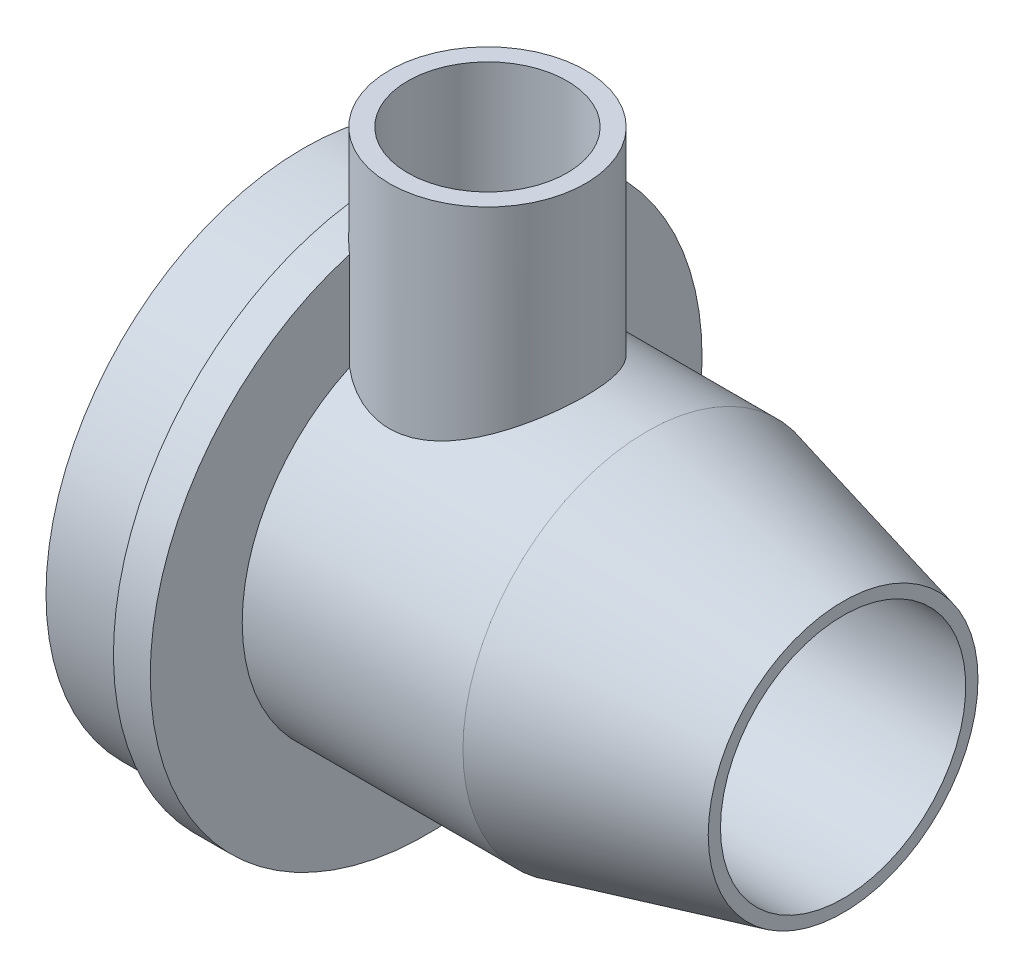
ISO-10303-21;
HEADER;
FILE_DESCRIPTION(('STEP AP214'),'2;1');
FILE_NAME('part.step','',(''),(''),'','','');
FILE_SCHEMA(('AUTOMOTIVE_DESIGN { 1 0 10303 214 1 1 1 1 }'));
ENDSEC;
DATA;
#1=APPLICATION_CONTEXT('core data for automotive mechanical design processes');
#2=APPLICATION_PROTOCOL_DEFINITION('international standard','automotive_design',2000,#1);
#3=PRODUCT_CONTEXT('',#1,'mechanical');
#4=PRODUCT('Part','Part','',(#3));
#5=PRODUCT_RELATED_PRODUCT_CATEGORY('part','',(#4));
#6=PRODUCT_DEFINITION_FORMATION('','',#4);
#7=PRODUCT_DEFINITION_CONTEXT('part definition',#1,'design');
#8=PRODUCT_DEFINITION('design','',#6,#7);
#9=PRODUCT_DEFINITION_SHAPE('','',#8);
#10=(LENGTH_UNIT() NAMED_UNIT(*) SI_UNIT(.MILLI.,.METRE.));
#11=(NAMED_UNIT(*) PLANE_ANGLE_UNIT() SI_UNIT($,.RADIAN.));
#12=(NAMED_UNIT(*) SI_UNIT($,.STERADIAN.) SOLID_ANGLE_UNIT());
#13=UNCERTAINTY_MEASURE_WITH_UNIT(LENGTH_MEASURE(1.E-05),#10,'distance_accuracy_value','');
#14=(GEOMETRIC_REPRESENTATION_CONTEXT(3) GLOBAL_UNCERTAINTY_ASSIGNED_CONTEXT((#13)) GLOBAL_UNIT_ASSIGNED_CONTEXT((#10,
#11,#12)) REPRESENTATION_CONTEXT('',''));
#15=CARTESIAN_POINT('',(0.,0.,0.));
#16=DIRECTION('',(0.,0.,1.));
#17=DIRECTION('',(1.,0.,0.));
#18=AXIS2_PLACEMENT_3D('',#15,#16,#17);
#19=CARTESIAN_POINT('',(0.,9.99999999999999,0.));
#20=DIRECTION('',(1.,0.,0.));
#21=DIRECTION('',(0.,0.,-1.));
#22=AXIS2_PLACEMENT_3D('',#19,#20,#21);
#23=PLANE('',#22);
#24=CARTESIAN_POINT('',(0.,0.,0.));
#25=DIRECTION('',(-1.,0.,0.));
#26=DIRECTION('',(0.,0.,1.));
#27=AXIS2_PLACEMENT_3D('',#24,#25,#26);
#28=CIRCLE('',#27,9.99999999999999);
#29=CARTESIAN_POINT('',(0.,0.,9.99999999999999));
#30=VERTEX_POINT('',#29);
#31=EDGE_CURVE('E110',#30,#30,#28,.T.);
#32=ORIENTED_EDGE('',*,*,#31,.F.);
#33=EDGE_LOOP('',(#32));
#34=FACE_BOUND('',#33,.T.);
#35=CARTESIAN_POINT('',(0.,0.,0.));
#36=DIRECTION('',(-1.,0.,0.));
#37=DIRECTION('',(0.,0.,1.));
#38=AXIS2_PLACEMENT_3D('',#35,#36,#37);
#39=CIRCLE('',#38,21.);
#40=CARTESIAN_POINT('',(0.,0.,21.));
#41=VERTEX_POINT('',#40);
#42=EDGE_CURVE('E11',#41,#41,#39,.T.);
#43=ORIENTED_EDGE('',*,*,#42,.T.);
#44=EDGE_LOOP('',(#43));
#45=FACE_BOUND('',#44,.T.);
#46=ADVANCED_FACE('F37',(#34,#45),#23,.F.);
#47=CARTESIAN_POINT('',(0.,0.,0.));
#48=DIRECTION('',(-1.,0.,0.));
#49=DIRECTION('',(0.,0.,1.));
#50=AXIS2_PLACEMENT_3D('',#47,#48,#49);
#51=CYLINDRICAL_SURFACE('',#50,21.);
#52=ORIENTED_EDGE('',*,*,#42,.F.);
#53=EDGE_LOOP('',(#52));
#54=FACE_BOUND('',#53,.T.);
#55=CARTESIAN_POINT('',(7.,0.,0.));
#56=DIRECTION('',(-1.,0.,0.));
#57=DIRECTION('',(0.,0.,1.));
#58=AXIS2_PLACEMENT_3D('',#55,#56,#57);
#59=CIRCLE('',#58,21.);
#60=CARTESIAN_POINT('',(7.,0.,21.));
#61=VERTEX_POINT('',#60);
#62=EDGE_CURVE('E44',#61,#61,#59,.T.);
#63=ORIENTED_EDGE('',*,*,#62,.T.);
#64=EDGE_LOOP('',(#63));
#65=FACE_BOUND('',#64,.T.);
#66=ADVANCED_FACE('F91',(#54,#65),#51,.T.);
#67=CARTESIAN_POINT('',(7.,21.,0.));
#68=DIRECTION('',(1.,0.,0.));
#69=DIRECTION('',(0.,0.,-1.));
#70=AXIS2_PLACEMENT_3D('',#67,#68,#69);
#71=PLANE('',#70);
#72=ORIENTED_EDGE('',*,*,#62,.F.);
#73=EDGE_LOOP('',(#72));
#74=FACE_BOUND('',#73,.T.);
#75=CARTESIAN_POINT('',(7.,0.,0.));
#76=DIRECTION('',(-1.,0.,0.));
#77=DIRECTION('',(0.,0.,1.));
#78=AXIS2_PLACEMENT_3D('',#75,#76,#77);
#79=CIRCLE('',#78,22.5);
#80=CARTESIAN_POINT('',(6.99999999999999,22.5,0.));
#81=VERTEX_POINT('',#80);
#82=EDGE_CURVE('E82',#81,#81,#79,.T.);
#83=ORIENTED_EDGE('',*,*,#82,.T.);
#84=EDGE_LOOP('',(#83));
#85=FACE_BOUND('',#84,.T.);
#86=ADVANCED_FACE('F93',(#74,#85),#71,.F.);
#87=CARTESIAN_POINT('',(0.,0.,0.));
#88=DIRECTION('',(-1.,0.,0.));
#89=DIRECTION('',(0.,0.,1.));
#90=AXIS2_PLACEMENT_3D('',#87,#88,#89);
#91=CYLINDRICAL_SURFACE('',#90,22.5);
#92=CARTESIAN_POINT('',(10.,0.,0.));
#93=DIRECTION('',(-1.,0.,0.));
#94=DIRECTION('',(0.,0.,1.));
#95=AXIS2_PLACEMENT_3D('',#92,#93,#94);
#96=CIRCLE('',#95,22.5);
#97=CARTESIAN_POINT('',(10.,21.6159663212173,-6.2449979983984));
#98=VERTEX_POINT('',#97);
#99=CARTESIAN_POINT('',(10.,21.6159663212173,6.2449979983984));
#100=VERTEX_POINT('',#99);
#101=EDGE_CURVE('E76',#98,#100,#96,.T.);
#102=ORIENTED_EDGE('',*,*,#101,.T.);
#103=CARTESIAN_POINT('',(15.,21.0297408448131,8.));
#104=CARTESIAN_POINT('',(15.2169039393865,21.0297403686148,8.00000055406925));
#105=CARTESIAN_POINT('',(15.4337999515287,21.0331056548089,7.99117141501444));
#106=CARTESIAN_POINT('',(15.8659578973729,21.0464543534831,7.95594837302906));
#107=CARTESIAN_POINT('',(16.0812198246633,21.0564377919173,7.92955440121525));
#108=CARTESIAN_POINT('',(16.5085145057331,21.0826975089156,7.85946951092131));
#109=CARTESIAN_POINT('',(16.7205472361938,21.0989738328995,7.81577846759695));
#110=CARTESIAN_POINT('',(17.1398864359343,21.1373014306634,7.71152174406925));
#111=CARTESIAN_POINT('',(17.3471928134739,21.1593528164359,7.65095573661765));
#112=CARTESIAN_POINT('',(17.7551941494095,21.2084929220989,7.51366254204978));
#113=CARTESIAN_POINT('',(17.9559038819811,21.2355693329456,7.43697478627154));
#114=CARTESIAN_POINT('',(18.3500524123259,21.2940096066575,7.26795347678701));
#115=CARTESIAN_POINT('',(18.5434886487771,21.3253749621535,7.1756144734702));
#116=CARTESIAN_POINT('',(18.921855259657,21.391499452057,6.97601583295978));
#117=CARTESIAN_POINT('',(19.106786800709,21.4262581189354,6.86875825038007));
#118=CARTESIAN_POINT('',(19.4672039919307,21.4982490780662,6.64000490158324));
#119=CARTESIAN_POINT('',(19.6426862021065,21.5354822602825,6.51850400059873));
#120=CARTESIAN_POINT('',(19.9900612817578,21.6129798084297,6.25687269809314));
#121=CARTESIAN_POINT('',(20.1615233518349,21.6533058628257,6.11618828389427));
#122=CARTESIAN_POINT('',(20.4921173310216,21.7344811261713,5.8211455977019));
#123=CARTESIAN_POINT('',(20.6512489649995,21.7753303467709,5.6667870207585));
#124=CARTESIAN_POINT('',(20.9562817472376,21.8564787978259,5.34526232392203));
#125=CARTESIAN_POINT('',(21.1021781295122,21.8967778257555,5.17809163007548));
#126=CARTESIAN_POINT('',(21.3797040628434,21.9757350161796,4.83203409050684));
#127=CARTESIAN_POINT('',(21.511338559477,22.0143937446315,4.65315134090452));
#128=CARTESIAN_POINT('',(21.7633112487399,22.0902127502264,4.27902188246688));
#129=CARTESIAN_POINT('',(21.883179839982,22.1272908410294,4.08344174585761));
#130=CARTESIAN_POINT('',(22.1058883366947,22.1975783460871,3.68225021031342));
#131=CARTESIAN_POINT('',(22.2087350227841,22.2307892992325,3.47664284815115));
#132=CARTESIAN_POINT('',(22.3965724735522,22.2924069822151,3.05673246199958));
#133=CARTESIAN_POINT('',(22.4815637192329,22.3208138414643,2.8424296724393));
#134=CARTESIAN_POINT('',(22.6328933020882,22.3719910721917,2.40668348611882));
#135=CARTESIAN_POINT('',(22.6992325582303,22.3947617213548,2.18524044175233));
#136=CARTESIAN_POINT('',(22.8103712274878,22.4332184376016,1.74569738261162));
#137=CARTESIAN_POINT('',(22.8559123801302,22.4491470085616,1.52780601401671));
#138=CARTESIAN_POINT('',(22.9287096609528,22.4747251862976,1.08862419151065));
#139=CARTESIAN_POINT('',(22.9559662243641,22.4843749425292,0.867333818634822));
#140=CARTESIAN_POINT('',(22.9919093583613,22.4971183142438,0.423117420772445));
#141=CARTESIAN_POINT('',(23.0006005854866,22.5002135737175,0.200191820011438));
#142=CARTESIAN_POINT('',(22.9993349889896,22.4997635194707,-0.245596806559894));
#143=CARTESIAN_POINT('',(22.989378664562,22.4962183835135,-0.468459833885575));
#144=CARTESIAN_POINT('',(22.9517876265751,22.4828965641572,-0.902421744924401));
#145=CARTESIAN_POINT('',(22.9249648843196,22.4734061681598,-1.11360036870596));
#146=CARTESIAN_POINT('',(22.8546435485118,22.4487046715339,-1.53289877382041));
#147=CARTESIAN_POINT('',(22.8111390694734,22.4334915519064,-1.74101744863327));
#148=CARTESIAN_POINT('',(22.7078653777766,22.3977419694763,-2.15263135057575));
#149=CARTESIAN_POINT('',(22.6481016135791,22.3772072900292,-2.35612810179868));
#150=CARTESIAN_POINT('',(22.512788746036,22.3313220583874,-2.75732508679096));
#151=CARTESIAN_POINT('',(22.4372336722266,22.3059696850231,-2.9550230958089));
#152=CARTESIAN_POINT('',(22.2698248275447,22.2507084747718,-3.34596401264463));
#153=CARTESIAN_POINT('',(22.1777636430794,22.2207424335494,-3.53910995392889));
#154=CARTESIAN_POINT('',(21.9787225009039,22.1572487326462,-3.91702175511175));
#155=CARTESIAN_POINT('',(21.8717374482465,22.1237198575638,-4.10178472442894));
#156=CARTESIAN_POINT('',(21.6436097047798,22.0539284351763,-4.46182382190772));
#157=CARTESIAN_POINT('',(21.5224659639433,22.0176656851942,-4.63709924504806));
#158=CARTESIAN_POINT('',(21.2668027360823,21.9432873741216,-4.9771925187229));
#159=CARTESIAN_POINT('',(21.1322826930059,21.9051717360404,-5.14200993405197));
#160=CARTESIAN_POINT('',(20.8431588000139,21.8259515885422,-5.46878311089091));
#161=CARTESIAN_POINT('',(20.6878666330062,21.784796055896,-5.63011809380076));
#162=CARTESIAN_POINT('',(20.3643529082191,21.7025763271781,-5.93917070092542));
#163=CARTESIAN_POINT('',(20.1961353328408,21.6615121069528,-6.08689248884659));
#164=CARTESIAN_POINT('',(19.8476351474524,21.5805660746324,-6.36793286334688));
#165=CARTESIAN_POINT('',(19.6673457031558,21.5406849510807,-6.50124317753765));
#166=CARTESIAN_POINT('',(19.2959361616905,21.463273259543,-6.75241964522067));
#167=CARTESIAN_POINT('',(19.1048203305013,21.4257417778191,-6.87029182207639));
#168=CARTESIAN_POINT('',(18.7091905087449,21.353444199574,-7.09184454900366));
#169=CARTESIAN_POINT('',(18.5044929439604,21.3187428467966,-7.19521891340348));
#170=CARTESIAN_POINT('',(18.0864407055235,21.254023170503,-7.38420472541178));
#171=CARTESIAN_POINT('',(17.8730897188078,21.2240028784127,-7.46982364492303));
#172=CARTESIAN_POINT('',(17.4391943274511,21.1696329857442,-7.62254655377806));
#173=CARTESIAN_POINT('',(17.2186512388676,21.1452823542593,-7.68965390946476));
#174=CARTESIAN_POINT('',(16.7720099057222,21.1030948497716,-7.804687755483));
#175=CARTESIAN_POINT('',(16.5459119969732,21.0852575840367,-7.85261540229677));
#176=CARTESIAN_POINT('',(16.1014945182129,21.057459818449,-7.92684512222909));
#177=CARTESIAN_POINT('',(15.8833585937386,21.0471470937726,-7.95411688702874));
#178=CARTESIAN_POINT('',(15.4453690215624,21.0333176978434,-7.99061525009719));
#179=CARTESIAN_POINT('',(15.2255154319616,21.0298007977082,-7.99984245610485));
#180=CARTESIAN_POINT('',(14.7858370684396,21.0296824240172,-8.00015351644898));
#181=CARTESIAN_POINT('',(14.5660122970282,21.0330796306058,-7.99124083356596));
#182=CARTESIAN_POINT('',(14.1280551527975,21.0466715548744,-7.95537448676005));
#183=CARTESIAN_POINT('',(13.9099227533875,21.0568661655332,-7.92842110687718));
#184=CARTESIAN_POINT('',(13.4859360478107,21.0831560634668,-7.85823559575561));
#185=CARTESIAN_POINT('',(13.2799462734823,21.0989907931301,-7.81572029875206));
#186=CARTESIAN_POINT('',(12.8723441309343,21.1361233790069,-7.71473786814156));
#187=CARTESIAN_POINT('',(12.6707333290575,21.1574231562462,-7.65626512485136));
#188=CARTESIAN_POINT('',(12.2732871371124,21.2048587587824,-7.52388872662456));
#189=CARTESIAN_POINT('',(12.0774504539273,21.2309934916034,-7.44998855708794));
#190=CARTESIAN_POINT('',(11.6925957896652,21.2873828155832,-7.28730007419787));
#191=CARTESIAN_POINT('',(11.5035804410051,21.3176389761822,-7.19850608628251));
#192=CARTESIAN_POINT('',(11.1271143421938,21.3825556319026,-7.0033737998732));
#193=CARTESIAN_POINT('',(10.9399425438214,21.4173320637911,-6.89653591157544));
#194=CARTESIAN_POINT('',(10.5751154719962,21.4894767253579,-6.66833635221323));
#195=CARTESIAN_POINT('',(10.3974635057894,21.5268458455374,-6.54696968051342));
#196=CARTESIAN_POINT('',(10.052700948247,21.6031826607767,-6.29050051597282));
#197=CARTESIAN_POINT('',(9.88559164713597,21.6421505505366,-6.15539634718374));
#198=CARTESIAN_POINT('',(9.56285218904932,21.720683045534,-5.87226604091336));
#199=CARTESIAN_POINT('',(9.40722235338081,21.7602476674365,-5.72423954199262));
#200=CARTESIAN_POINT('',(9.0999109557493,21.8411963301025,-5.40743419775893));
#201=CARTESIAN_POINT('',(8.94894269529276,21.8825576767522,-5.23795663006815));
#202=CARTESIAN_POINT('',(8.66182910282255,21.9636847556591,-4.88661864826377));
#203=CARTESIAN_POINT('',(8.52567889948004,22.0034510095605,-4.70476233572327));
#204=CARTESIAN_POINT('',(8.26904953699842,22.0803237501562,-4.32966088554577));
#205=CARTESIAN_POINT('',(8.14857666435117,22.1174291672139,-4.13641122411906));
#206=CARTESIAN_POINT('',(7.92434012120138,22.1879164116791,-3.73990473891316));
#207=CARTESIAN_POINT('',(7.82056937285322,22.2212998145086,-3.53665220197823));
#208=CARTESIAN_POINT('',(7.63100283132751,22.2832701888114,-3.1224205481641));
#209=CARTESIAN_POINT('',(7.54512327054174,22.3118793820243,-2.91148313268091));
#210=CARTESIAN_POINT('',(7.39152631527466,22.3636679084546,-2.4825389576666));
#211=CARTESIAN_POINT('',(7.32380154300457,22.3868494468898,-2.26453511030527));
#212=CARTESIAN_POINT('',(7.20713956515717,22.4271191684516,-1.82303348337415));
#213=CARTESIAN_POINT('',(7.15819973389537,22.4442082031404,-1.59953647626659));
#214=CARTESIAN_POINT('',(7.0796060036813,22.4717885905069,-1.14877792247743));
#215=CARTESIAN_POINT('',(7.04995113254958,22.4822802757645,-0.921516566153846));
#216=CARTESIAN_POINT('',(7.01129756356565,22.4959788226846,-0.477180527821484));
#217=CARTESIAN_POINT('',(7.00128752498177,22.4995422609465,-0.260204221335547));
#218=CARTESIAN_POINT('',(6.99894548724806,22.5003748907887,0.173854135920281));
#219=CARTESIAN_POINT('',(7.00661305234478,22.4976442375187,0.390936183951765));
#220=CARTESIAN_POINT('',(7.0395478049048,22.4859637035569,0.823566433469688));
#221=CARTESIAN_POINT('',(7.06481316041561,22.4770144702274,1.03911479225582));
#222=CARTESIAN_POINT('',(7.13269435145875,22.4531398677818,1.46712365664306));
#223=CARTESIAN_POINT('',(7.17531020554786,22.438214492274,1.67958415894138));
#224=CARTESIAN_POINT('',(7.2764486308927,22.4031481336315,2.09562655519884));
#225=CARTESIAN_POINT('',(7.33462974176769,22.3831195055209,2.29930114560484));
#226=CARTESIAN_POINT('',(7.46677963793882,22.3382082570201,2.7009831625613));
#227=CARTESIAN_POINT('',(7.54075368694825,22.3133240185159,2.89898867461897));
#228=CARTESIAN_POINT('',(7.70386690735499,22.2593270292008,3.28799593804458));
#229=CARTESIAN_POINT('',(7.79300276154975,22.2302152035335,3.47899921032271));
#230=CARTESIAN_POINT('',(7.98582528850703,22.1684529254927,3.853003816085));
#231=CARTESIAN_POINT('',(8.08951757390176,22.1358011092896,4.03600202713024));
#232=CARTESIAN_POINT('',(8.31508603795478,22.0664022955244,4.39994875243892));
#233=CARTESIAN_POINT('',(8.43751814528258,22.0295445666565,4.58053168694211));
#234=CARTESIAN_POINT('',(8.69653731065842,21.9537764654284,4.93090726844277));
#235=CARTESIAN_POINT('',(8.83313076246327,21.9148651698226,5.10069498516603));
#236=CARTESIAN_POINT('',(9.1195819927899,21.8359877356758,5.42844885674597));
#237=CARTESIAN_POINT('',(9.26944095861232,21.7960215029401,5.58641395110501));
#238=CARTESIAN_POINT('',(9.58152603513098,21.7160565556558,5.88960726818061));
#239=CARTESIAN_POINT('',(9.74375236303727,21.676057840549,6.03483526709705));
#240=CARTESIAN_POINT('',(10.0874597398383,21.5952281410747,6.31813419672714));
#241=CARTESIAN_POINT('',(10.2694851816545,21.5544448205448,6.45555918397571));
#242=CARTESIAN_POINT('',(10.6448758791791,21.4751825880901,6.7145268094497));
#243=CARTESIAN_POINT('',(10.8382368540589,21.4367028171921,6.83607538808187));
#244=CARTESIAN_POINT('',(11.2352255335431,21.3631803430636,7.06248574190986));
#245=CARTESIAN_POINT('',(11.4388571063826,21.3281389496938,7.16734116719195));
#246=CARTESIAN_POINT('',(11.854888497244,21.2626329148589,7.35939803966408));
#247=CARTESIAN_POINT('',(12.0672844215919,21.232166268326,7.44660722689118));
#248=CARTESIAN_POINT('',(12.4996611293842,21.1767724194567,7.60270901671434));
#249=CARTESIAN_POINT('',(12.7196493580695,21.1518508439759,7.67158302750105));
#250=CARTESIAN_POINT('',(13.1653562303156,21.1084517934989,7.7902028005447));
#251=CARTESIAN_POINT('',(13.3910749055035,21.0899743540771,7.83994845720518));
#252=CARTESIAN_POINT('',(13.8463386883819,21.0601369581945,7.91975066298651));
#253=CARTESIAN_POINT('',(14.0758821667101,21.0487740467047,7.9498153868468));
#254=CARTESIAN_POINT('',(14.5369535197386,21.0335764679858,7.9899391648435));
#255=CARTESIAN_POINT('',(14.7684812756164,21.0297413530972,7.99999940859808));
#256=CARTESIAN_POINT('',(15.,21.0297408448131,8.));
#257=B_SPLINE_CURVE_WITH_KNOTS('',3,(#103,#104,#105,#106,#107,#108,#109,#110,#111,#112,#113,
#114,#115,#116,#117,#118,#119,#120,#121,#122,#123,#124,#125,#126,#127,#128,#129,#130,#131,#132,
#133,#134,#135,#136,#137,#138,#139,#140,#141,#142,#143,#144,#145,#146,#147,#148,#149,#150,#151,
#152,#153,#154,#155,#156,#157,#158,#159,#160,#161,#162,#163,#164,#165,#166,#167,#168,#169,#170,
#171,#172,#173,#174,#175,#176,#177,#178,#179,#180,#181,#182,#183,#184,#185,#186,#187,#188,#189,
#190,#191,#192,#193,#194,#195,#196,#197,#198,#199,#200,#201,#202,#203,#204,#205,#206,#207,#208,
#209,#210,#211,#212,#213,#214,#215,#216,#217,#218,#219,#220,#221,#222,#223,#224,#225,#226,#227,
#228,#229,#230,#231,#232,#233,#234,#235,#236,#237,#238,#239,#240,#241,#242,#243,#244,#245,#246,
#247,#248,#249,#250,#251,#252,#253,#254,#255,#256),.UNSPECIFIED.,.T.,.F.,(4,2,2,2,2,2,2,2,2,2,2,
2,2,2,2,2,2,2,2,2,2,2,2,2,2,2,2,2,2,2,2,2,2,2,2,2,2,2,2,2,2,2,2,2,2,2,2,2,2,2,2,2,2,2,2,2,2,2,2,
2,2,2,2,2,2,2,2,2,2,2,2,2,2,2,2,2,4),(0.,0.650493603027151,1.30098975708243,1.95149060627766,
2.60200407120866,3.25094461463127,3.90011157869133,4.5491892266569,5.19850159322882,
5.87402333153681,6.549560138568,7.2253392472695,7.90088326172102,8.5971225570843,
9.29308383683845,9.98902636590412,10.6849346004622,11.3535923077929,12.0222340983898,
12.6907081612062,13.3591643292351,13.9976737786639,14.6364087082877,15.2749298619206,
15.913692869228,16.561130766062,17.2087902389627,17.8564977736691,18.5042322447884,
19.1864917337398,19.868541850642,20.5509814180211,21.2331539256521,21.9280677825926,
22.6226886075729,23.317183031794,24.011635573653,24.671025391009,25.3303929998022,
25.9896347516415,26.6488661243566,27.2809229847016,27.9132023252733,28.5453389741176,
29.1777170171081,29.831911999174,30.4863327983323,31.1408335315823,31.7953525771818,
32.486651350567,33.1777221736407,33.8690692625735,34.5601226041314,35.247863826414,
35.9353251375268,36.622690323004,37.3100208548383,37.9609282028906,38.6118195062293,
39.2626430610764,39.913467311997,40.551043212784,41.1888319473482,41.8264813212296,
42.4643772371279,43.1274349994323,43.7907934426778,44.4542113185084,45.117640848743,
45.8118916075384,46.5058818528531,47.2001354578027,47.8940838842296,48.5887333147756,
49.2833865800198,49.9777511283253,50.6720743832117),.UNSPECIFIED.);
#258=EDGE_CURVE('E64',#81,#100,#257,.T.);
#259=ORIENTED_EDGE('',*,*,#258,.F.);
#260=ORIENTED_EDGE('',*,*,#82,.F.);
#261=EDGE_CURVE('E57',#98,#81,#257,.T.);
#262=ORIENTED_EDGE('',*,*,#261,.F.);
#263=EDGE_LOOP('',(#102,#259,#260,#262));
#264=FACE_BOUND('',#263,.T.);
#265=ADVANCED_FACE('F81',(#264),#91,.T.);
#266=CARTESIAN_POINT('',(10.,22.5,0.));
#267=DIRECTION('',(-1.,0.,0.));
#268=DIRECTION('',(0.,0.,1.));
#269=AXIS2_PLACEMENT_3D('',#266,#267,#268);
#270=PLANE('',#269);
#271=CARTESIAN_POINT('',(10.,0.,0.));
#272=DIRECTION('',(-1.,0.,0.));
#273=DIRECTION('',(0.,0.,1.));
#274=AXIS2_PLACEMENT_3D('',#271,#272,#273);
#275=CIRCLE('',#274,15.);
#276=CARTESIAN_POINT('',(10.,13.6381816969858,-6.2449979983984));
#277=VERTEX_POINT('',#276);
#278=CARTESIAN_POINT('',(10.,13.6381816969858,6.2449979983984));
#279=VERTEX_POINT('',#278);
#280=EDGE_CURVE('E78',#277,#279,#275,.T.);
#281=ORIENTED_EDGE('',*,*,#280,.T.);
#282=DIRECTION('',(0.,1.,0.));
#283=VECTOR('',#282,1.);
#284=CARTESIAN_POINT('',(10.,-22.502,6.2449979983984));
#285=LINE('',#284,#283);
#286=EDGE_CURVE('E51',#100,#279,#285,.F.);
#287=ORIENTED_EDGE('',*,*,#286,.F.);
#288=ORIENTED_EDGE('',*,*,#101,.F.);
#289=DIRECTION('',(0.,1.,0.));
#290=VECTOR('',#289,1.);
#291=CARTESIAN_POINT('',(10.,-22.502,-6.2449979983984));
#292=LINE('',#291,#290);
#293=EDGE_CURVE('E122',#277,#98,#292,.T.);
#294=ORIENTED_EDGE('',*,*,#293,.F.);
#295=EDGE_LOOP('',(#281,#287,#288,#294));
#296=FACE_BOUND('',#295,.T.);
#297=ADVANCED_FACE('F74',(#296),#270,.F.);
#298=CARTESIAN_POINT('',(0.,0.,0.));
#299=DIRECTION('',(-1.,0.,0.));
#300=DIRECTION('',(0.,0.,1.));
#301=AXIS2_PLACEMENT_3D('',#298,#299,#300);
#302=CYLINDRICAL_SURFACE('',#301,15.);
#303=ORIENTED_EDGE('',*,*,#280,.F.);
#304=CARTESIAN_POINT('',(15.,12.6885775404495,8.));
#305=CARTESIAN_POINT('',(15.2062807278142,12.6885765278676,8.00000082721682));
#306=CARTESIAN_POINT('',(15.4125521905369,12.6936244616965,7.99201174654624));
#307=CARTESIAN_POINT('',(15.8234599547187,12.7136132089408,7.96017537563484));
#308=CARTESIAN_POINT('',(16.0280956119096,12.728557742943,7.93632212130752));
#309=CARTESIAN_POINT('',(16.4343029929785,12.7677833039786,7.87306095334852));
#310=CARTESIAN_POINT('',(16.6358703345715,12.7920765809839,7.83363262937667));
#311=CARTESIAN_POINT('',(17.0343271601007,12.8491080572074,7.73973085972861));
#312=CARTESIAN_POINT('',(17.2312145301626,12.8818499962724,7.68525075053985));
#313=CARTESIAN_POINT('',(17.617774028385,12.9544169307915,7.56228385666899));
#314=CARTESIAN_POINT('',(17.8074842506989,12.9941952837498,7.49388888707304));
#315=CARTESIAN_POINT('',(18.1801055790204,13.0797616840841,7.3435222093617));
#316=CARTESIAN_POINT('',(18.363014165682,13.125551930383,7.26154553068372));
#317=CARTESIAN_POINT('',(18.7211610934478,13.2218490629248,7.0846895469615));
#318=CARTESIAN_POINT('',(18.8964005143577,13.2723552820083,6.9898120661042));
#319=CARTESIAN_POINT('',(19.2385247754625,13.3767912234906,6.78781438160603));
#320=CARTESIAN_POINT('',(19.4054093312025,13.4307210623105,6.68069376153462));
#321=CARTESIAN_POINT('',(19.9234942274333,13.6062056303797,6.32032913923123));
#322=CARTESIAN_POINT('',(20.2582015924694,13.7320055318079,6.04463813970563));
#323=CARTESIAN_POINT('',(20.7236252823563,13.9190407271586,5.59347847675013));
#324=CARTESIAN_POINT('',(20.8727421303169,13.98114670239,5.43671146220673));
#325=CARTESIAN_POINT('',(21.1582050160213,14.1034342850554,5.11109924634898));
#326=CARTESIAN_POINT('',(21.2945489901401,14.1636155805014,4.94225210107677));
#327=CARTESIAN_POINT('',(21.5638830240319,14.2852717014807,4.57935642046023));
#328=CARTESIAN_POINT('',(21.6957394295338,14.3464672523525,4.3843718855975));
#329=CARTESIAN_POINT('',(21.9423529059423,14.463211026805,3.98237404529215));
#330=CARTESIAN_POINT('',(22.0571173837356,14.5187616932942,3.77536600468325));
#331=CARTESIAN_POINT('',(22.2684185508285,14.6226346324678,3.35057394862973));
#332=CARTESIAN_POINT('',(22.364960678775,14.6709590609995,3.13279317298695));
#333=CARTESIAN_POINT('',(22.5386923688465,14.7589385631076,2.68795642145345));
#334=CARTESIAN_POINT('',(22.6158843238,14.7985947085199,2.4609015964273));
#335=CARTESIAN_POINT('',(22.744553769798,14.8652391133082,2.01763632127899));
#336=CARTESIAN_POINT('',(22.7975824828434,14.8929813683054,1.80198906047704));
#337=CARTESIAN_POINT('',(22.8856372968399,14.9392726976933,1.36607301961615));
#338=CARTESIAN_POINT('',(22.9206642676045,14.9578222162598,1.14580446338573));
#339=CARTESIAN_POINT('',(22.9722035929783,14.9851777815142,0.702641151594255));
#340=CARTESIAN_POINT('',(22.9887268856328,14.9939895843995,0.479748026324828));
#341=CARTESIAN_POINT('',(23.0030487482147,15.0016248937834,0.0331964913150459));
#342=CARTESIAN_POINT('',(23.0008486800895,15.0004491267833,-0.190461861579219));
#343=CARTESIAN_POINT('',(22.9789062156974,14.9887583249268,-0.614471057868572));
#344=CARTESIAN_POINT('',(22.9609184604038,14.9791774779261,-0.814941475222453));
#345=CARTESIAN_POINT('',(22.9099877831977,14.9521717230929,-1.2134408868588));
#346=CARTESIAN_POINT('',(22.8770447511722,14.9347467575056,-1.41146986315436));
#347=CARTESIAN_POINT('',(22.796580461212,14.8924644313708,-1.80372417544334));
#348=CARTESIAN_POINT('',(22.7490593478838,14.8676071445479,-1.99794954914608));
#349=CARTESIAN_POINT('',(22.6399461839264,14.811029806268,-2.3813778812323));
#350=CARTESIAN_POINT('',(22.5783535989998,14.7793094942225,-2.57058064860158));
#351=CARTESIAN_POINT('',(22.4408878293681,14.7092919056294,-2.9450691030465));
#352=CARTESIAN_POINT('',(22.3648554927688,14.6709217934463,-3.1302827348265));
#353=CARTESIAN_POINT('',(22.1996629526356,14.5886953872264,-3.49352300483046));
#354=CARTESIAN_POINT('',(22.1104984168043,14.5448372834282,-3.67154724649229));
#355=CARTESIAN_POINT('',(21.8243650223232,14.4063856676657,-4.19348838897107));
#356=CARTESIAN_POINT('',(21.6086725891169,14.3048709118572,-4.52549971196681));
#357=CARTESIAN_POINT('',(21.1081019673324,14.0802637401868,-5.18456327218351));
#358=CARTESIAN_POINT('',(20.8183719820867,13.9560254510799,-5.50754077984474));
#359=CARTESIAN_POINT('',(20.3480315723057,13.7688338304178,-5.95360340169782));
#360=CARTESIAN_POINT('',(20.1851468423618,13.7062463622372,-6.0959904466473));
#361=CARTESIAN_POINT('',(19.8480258548273,13.5822961853233,-6.36737369068614));
#362=CARTESIAN_POINT('',(19.6737877330341,13.5209336798982,-6.49636768160105));
#363=CARTESIAN_POINT('',(19.3004300754052,13.3962802284654,-6.74990405312194));
#364=CARTESIAN_POINT('',(19.1004340894718,13.3332248820359,-6.87327380044759));
#365=CARTESIAN_POINT('',(18.6891810872363,13.2125488792136,-7.10248719563441));
#366=CARTESIAN_POINT('',(18.4779291941893,13.154925782791,-7.20833872853441));
#367=CARTESIAN_POINT('',(18.0453911986685,13.0472441446601,-7.40146247077417));
#368=CARTESIAN_POINT('',(17.8241117090905,12.9971807093155,-7.48874671446712));
#369=CARTESIAN_POINT('',(17.3728854274168,12.9066564433152,-7.64370915928796));
#370=CARTESIAN_POINT('',(17.1429399766908,12.8661941335559,-7.71139038071889));
#371=CARTESIAN_POINT('',(16.695173176445,12.7995566447755,-7.82145437166402));
#372=CARTESIAN_POINT('',(16.4778796048528,12.7724893252617,-7.86544291947862));
#373=CARTESIAN_POINT('',(16.0393230446094,12.7292029555451,-7.93530677234208));
#374=CARTESIAN_POINT('',(15.8180603009447,12.7129832381527,-7.96118319139483));
#375=CARTESIAN_POINT('',(15.3737830861565,12.6921440125064,-7.99436472687623));
#376=CARTESIAN_POINT('',(15.1507702196287,12.6875148968984,-8.00168522421754));
#377=CARTESIAN_POINT('',(14.7049912170028,12.6900500928086,-7.99766461379362));
#378=CARTESIAN_POINT('',(14.4822250599286,12.6972133099323,-7.98632523776911));
#379=CARTESIAN_POINT('',(14.0685944326207,12.7212695878385,-7.94793800232505));
#380=CARTESIAN_POINT('',(13.877428255546,12.7367415686164,-7.92318043725929));
#381=CARTESIAN_POINT('',(13.498120027255,12.7757602066192,-7.86010987830084));
#382=CARTESIAN_POINT('',(13.3099789763214,12.7993094794345,-7.82179249333659));
#383=CARTESIAN_POINT('',(12.9379596234833,12.8537208452295,-7.73205060893869));
#384=CARTESIAN_POINT('',(12.7540810067234,12.8845823961677,-7.68062708101061));
#385=CARTESIAN_POINT('',(12.3914756465384,12.9527088743853,-7.56517167807626));
#386=CARTESIAN_POINT('',(12.2127509948307,12.9899763599403,-7.50113476428877));
#387=CARTESIAN_POINT('',(11.8536291974278,13.0716388473629,-7.35794410875103));
#388=CARTESIAN_POINT('',(11.6735024193768,13.1162747460405,-7.27825059129718));
#389=CARTESIAN_POINT('',(11.3205301449079,13.2102058334668,-7.1063390899348));
#390=CARTESIAN_POINT('',(11.1476870969663,13.2595025712086,-7.01411693775347));
#391=CARTESIAN_POINT('',(10.80993506778,13.3615387544223,-6.81773611086282));
#392=CARTESIAN_POINT('',(10.6450279439668,13.4142789991174,-6.7135746608251));
#393=CARTESIAN_POINT('',(10.3237397234439,13.5220005778033,-6.49387939192664));
#394=CARTESIAN_POINT('',(10.1673592142852,13.5769820657783,-6.37834479090124));
#395=CARTESIAN_POINT('',(9.84126310749805,13.6962134405586,-6.11858240062042));
#396=CARTESIAN_POINT('',(9.67297661508524,13.7606355432632,-5.97263494643755));
#397=CARTESIAN_POINT('',(9.34909568951298,13.8892269606575,-5.66717190397729));
#398=CARTESIAN_POINT('',(9.19350179395305,13.9533962645304,-5.50765574157632));
#399=CARTESIAN_POINT('',(8.89575652099994,14.0799012133675,-5.17570667470744));
#400=CARTESIAN_POINT('',(8.75361127286622,14.1422360134202,-5.00326794429017));
#401=CARTESIAN_POINT('',(8.48371509791509,14.2634999947603,-4.64630001674158));
#402=CARTESIAN_POINT('',(8.35596603150284,14.3224287354076,-4.46176926183108));
#403=CARTESIAN_POINT('',(8.11079706126083,14.4377604357269,-4.07354485209451));
#404=CARTESIAN_POINT('',(7.99403497034841,14.4939538454569,-3.86937210530987));
#405=CARTESIAN_POINT('',(7.77838846080179,14.5994119794807,-3.45019516311609));
#406=CARTESIAN_POINT('',(7.67949554777388,14.6486799933833,-3.2351961766117));
#407=CARTESIAN_POINT('',(7.5007106400471,14.7388392730691,-2.7958660338929));
#408=CARTESIAN_POINT('',(7.42080837788382,14.7797350637035,-2.57153999786994));
#409=CARTESIAN_POINT('',(7.28101763497864,14.8519055817779,-2.11523636390425));
#410=CARTESIAN_POINT('',(7.22112638342336,14.8831816411609,-1.88325983017466));
#411=CARTESIAN_POINT('',(7.12714248736603,14.9325301276959,-1.43696201236957));
#412=CARTESIAN_POINT('',(7.09108421315627,14.9516024544314,-1.22316354703815));
#413=CARTESIAN_POINT('',(7.03641876585113,14.980590276506,-0.792732859071633));
#414=CARTESIAN_POINT('',(7.01781041670243,14.9905063889356,-0.576100828405125));
#415=CARTESIAN_POINT('',(6.99830784829529,15.0009003023475,-0.141899650138892));
#416=CARTESIAN_POINT('',(6.99740678374335,15.0013817505881,0.0756691028066763));
#417=CARTESIAN_POINT('',(7.01331464580508,14.9929015247902,0.509967983611449));
#418=CARTESIAN_POINT('',(7.03012283806224,14.9839402423169,0.726698145870781));
#419=CARTESIAN_POINT('',(7.07912557629477,14.9579364778125,1.13993624878349));
#420=CARTESIAN_POINT('',(7.10995534290214,14.9416116877612,1.33665343467825));
#421=CARTESIAN_POINT('',(7.18601479277237,14.9015877717357,1.72658766317705));
#422=CARTESIAN_POINT('',(7.23124933079464,14.8778861596536,1.91980350250514));
#423=CARTESIAN_POINT('',(7.33561903616672,14.8236550798794,2.30138685131234));
#424=CARTESIAN_POINT('',(7.39474992219062,14.7931277152739,2.48975583426772));
#425=CARTESIAN_POINT('',(7.52637106048317,14.7258931428121,2.86070279929688));
#426=CARTESIAN_POINT('',(7.59886643617933,14.6891835654033,3.04327852889162));
#427=CARTESIAN_POINT('',(7.75951664727418,14.6088870094687,3.40831874929691));
#428=CARTESIAN_POINT('',(7.84815461728315,14.5650946183864,3.59052521056868));
#429=CARTESIAN_POINT('',(8.03842246639471,14.4726171787796,3.94680147694489));
#430=CARTESIAN_POINT('',(8.14005708788577,14.4239303457008,4.1208682801224));
#431=CARTESIAN_POINT('',(8.35559356809658,14.3226773019175,4.46007274030208));
#432=CARTESIAN_POINT('',(8.46949708456935,14.27011056727,4.62520918610965));
#433=CARTESIAN_POINT('',(8.70888250863408,14.1621589491846,4.94589577335682));
#434=CARTESIAN_POINT('',(8.83436535335322,14.1067738378156,5.10144513720167));
#435=CARTESIAN_POINT('',(9.11072930311086,13.9880757213701,5.41899884131155));
#436=CARTESIAN_POINT('',(9.26288504899367,13.9245623740845,5.5798208931335));
#437=CARTESIAN_POINT('',(9.57987546852364,13.7969814658701,5.88822197092355));
#438=CARTESIAN_POINT('',(9.74471127657023,13.7329138558113,6.03579980945654));
#439=CARTESIAN_POINT('',(10.0864794768472,13.6057891395714,6.31714795862603));
#440=CARTESIAN_POINT('',(10.2634251123246,13.5427332358677,6.4509027380205));
#441=CARTESIAN_POINT('',(10.6284699577914,13.4194175576809,6.70365634186985));
#442=CARTESIAN_POINT('',(10.81656852891,13.3591576233888,6.82265601033328));
#443=CARTESIAN_POINT('',(11.2135816131552,13.2400605704134,7.0511191804652));
#444=CARTESIAN_POINT('',(11.4230717467018,13.1814769115307,7.1597181585176));
#445=CARTESIAN_POINT('',(11.8524556356397,13.0714949582071,7.35859675792892));
#446=CARTESIAN_POINT('',(12.0723511524838,13.0200978861982,7.4488732638284));
#447=CARTESIAN_POINT('',(12.5204548842902,12.926727469513,7.60975396300028));
#448=CARTESIAN_POINT('',(12.7486376174314,12.8847276803626,7.68041349816538));
#449=CARTESIAN_POINT('',(13.2119704389893,12.8119002549363,7.80129547673929));
#450=CARTESIAN_POINT('',(13.4471158061931,12.7810652276082,7.85153144322959));
#451=CARTESIAN_POINT('',(13.9011687847857,12.7342469976794,7.92721566236378));
#452=CARTESIAN_POINT('',(14.1196655269727,12.7171886311339,7.95446803384319));
#453=CARTESIAN_POINT('',(14.5587783252632,12.6943542313888,7.99086010160622));
#454=CARTESIAN_POINT('',(14.7793944609155,12.6885786233484,7.99999911533853));
#455=CARTESIAN_POINT('',(15.,12.6885775404495,8.));
#456=B_SPLINE_CURVE_WITH_KNOTS('',3,(#304,#305,#306,#307,#308,#309,#310,#311,#312,#313,#314,
#315,#316,#317,#318,#319,#320,#321,#322,#323,#324,#325,#326,#327,#328,#329,#330,#331,#332,#333,
#334,#335,#336,#337,#338,#339,#340,#341,#342,#343,#344,#345,#346,#347,#348,#349,#350,#351,#352,
#353,#354,#355,#356,#357,#358,#359,#360,#361,#362,#363,#364,#365,#366,#367,#368,#369,#370,#371,
#372,#373,#374,#375,#376,#377,#378,#379,#380,#381,#382,#383,#384,#385,#386,#387,#388,#389,#390,
#391,#392,#393,#394,#395,#396,#397,#398,#399,#400,#401,#402,#403,#404,#405,#406,#407,#408,#409,
#410,#411,#412,#413,#414,#415,#416,#417,#418,#419,#420,#421,#422,#423,#424,#425,#426,#427,#428,
#429,#430,#431,#432,#433,#434,#435,#436,#437,#438,#439,#440,#441,#442,#443,#444,#445,#446,#447,
#448,#449,#450,#451,#452,#453,#454,#455),.UNSPECIFIED.,.T.,.F.,(4,2,2,2,2,2,2,2,2,2,2,2,2,2,2,2,
2,2,2,2,2,2,2,2,2,2,2,2,2,2,2,2,2,2,2,2,2,2,2,2,2,2,2,2,2,2,2,2,2,2,2,2,2,2,2,2,2,2,2,2,2,2,2,2,
2,2,2,2,2,2,2,2,2,2,2,4),(0.,0.618612409650024,1.23745751626331,1.85711629277478,
2.47704983661099,3.09301829929052,3.70921269086573,4.32532004234234,4.94144835595199,
6.28932977416371,6.96411577792085,7.63901061484623,8.36770205136597,9.09607678055244,
9.82423377390031,10.5523006794077,11.2227676082844,11.893202138292,12.5632401460203,
13.2332294152304,13.8370243737463,14.4408237779643,15.0446171930172,15.6484335380709,
16.2593380665151,16.8704445849759,18.0919304974033,19.4399210054334,20.1150149937977,
20.7902201118518,21.5191974534642,22.247845780935,22.9760203876177,23.7040827422555,
24.3731385063228,25.0421531158554,25.7106130008442,26.3790108525116,26.9584945190621,
27.5381660115756,28.1177945478678,28.6976551048499,29.3029446478204,29.9084360658682,
30.5140685188859,31.1197426521452,31.8146386998427,32.5095641648474,33.2048048336834,
33.900135245042,34.6246245718508,35.3487685900283,36.0725201981181,36.796171550777,
37.4482560471201,38.1002965924857,38.7520850666368,39.4038465138906,40.0025200642457,
40.6013955961121,41.2000868617385,41.7990081214938,42.4202632353426,43.041745691238,
43.6633122264161,44.2849291098185,44.9751514824991,45.665435676684,46.3564872122069,
47.0474992005699,47.7759050365521,48.5044346233654,49.2308875558424,49.9568586947104,
50.6184046538861,51.2799755411001),.UNSPECIFIED.);
#457=EDGE_CURVE('E79',#279,#277,#456,.T.);
#458=ORIENTED_EDGE('',*,*,#457,.F.);
#459=EDGE_LOOP('',(#303,#458));
#460=FACE_BOUND('',#459,.T.);
#461=CARTESIAN_POINT('',(28.,0.,0.));
#462=DIRECTION('',(-1.,0.,0.));
#463=DIRECTION('',(0.,0.,1.));
#464=AXIS2_PLACEMENT_3D('',#461,#462,#463);
#465=CIRCLE('',#464,15.);
#466=CARTESIAN_POINT('',(28.,0.,15.));
#467=VERTEX_POINT('',#466);
#468=EDGE_CURVE('E85',#467,#467,#465,.T.);
#469=ORIENTED_EDGE('',*,*,#468,.T.);
#470=EDGE_LOOP('',(#469));
#471=FACE_BOUND('',#470,.T.);
#472=ADVANCED_FACE('F128',(#460,#471),#302,.T.);
#473=CARTESIAN_POINT('',(44.,0.,0.));
#474=DIRECTION('',(-1.,0.,0.));
#475=DIRECTION('',(0.,0.,1.));
#476=AXIS2_PLACEMENT_3D('',#473,#474,#475);
#477=CONICAL_SURFACE('',#476,11.,0.244978663126864);
#478=ORIENTED_EDGE('',*,*,#468,.F.);
#479=EDGE_LOOP('',(#478));
#480=FACE_BOUND('',#479,.T.);
#481=CARTESIAN_POINT('',(44.,0.,0.));
#482=DIRECTION('',(-1.,0.,0.));
#483=DIRECTION('',(0.,0.,1.));
#484=AXIS2_PLACEMENT_3D('',#481,#482,#483);
#485=CIRCLE('',#484,11.);
#486=CARTESIAN_POINT('',(44.,0.,11.));
#487=VERTEX_POINT('',#486);
#488=EDGE_CURVE('E117',#487,#487,#485,.T.);
#489=ORIENTED_EDGE('',*,*,#488,.T.);
#490=EDGE_LOOP('',(#489));
#491=FACE_BOUND('',#490,.T.);
#492=ADVANCED_FACE('F130',(#480,#491),#477,.T.);
#493=CARTESIAN_POINT('',(44.,11.,0.));
#494=DIRECTION('',(-1.,0.,0.));
#495=DIRECTION('',(0.,0.,1.));
#496=AXIS2_PLACEMENT_3D('',#493,#494,#495);
#497=PLANE('',#496);
#498=ORIENTED_EDGE('',*,*,#488,.F.);
#499=EDGE_LOOP('',(#498));
#500=FACE_BOUND('',#499,.T.);
#501=CARTESIAN_POINT('',(44.,0.,0.));
#502=DIRECTION('',(-1.,0.,0.));
#503=DIRECTION('',(0.,0.,1.));
#504=AXIS2_PLACEMENT_3D('',#501,#502,#503);
#505=CIRCLE('',#504,10.);
#506=CARTESIAN_POINT('',(44.,0.,10.));
#507=VERTEX_POINT('',#506);
#508=EDGE_CURVE('E113',#507,#507,#505,.T.);
#509=ORIENTED_EDGE('',*,*,#508,.T.);
#510=EDGE_LOOP('',(#509));
#511=FACE_BOUND('',#510,.T.);
#512=ADVANCED_FACE('F133',(#500,#511),#497,.F.);
#513=CARTESIAN_POINT('',(0.,0.,0.));
#514=DIRECTION('',(-1.,0.,0.));
#515=DIRECTION('',(0.,0.,1.));
#516=AXIS2_PLACEMENT_3D('',#513,#514,#515);
#517=CYLINDRICAL_SURFACE('',#516,10.);
#518=CARTESIAN_POINT('',(15.,7.59934207678533,6.5));
#519=CARTESIAN_POINT('',(14.8400583388866,7.59933308957921,6.50000533290813));
#520=CARTESIAN_POINT('',(14.6801606960161,7.6044087600796,6.4940889906187));
#521=CARTESIAN_POINT('',(14.3618002704686,7.62444014081335,6.47056145597246));
#522=CARTESIAN_POINT('',(14.2033378716651,7.6393984195191,6.45294722334845));
#523=CARTESIAN_POINT('',(13.889058410543,7.67853067881418,6.40633145436978));
#524=CARTESIAN_POINT('',(13.7332450114755,7.70271648390633,6.37731530573234));
#525=CARTESIAN_POINT('',(13.4255273424417,7.75925539917608,6.30840207637399));
#526=CARTESIAN_POINT('',(13.2736250805977,7.79161261621205,6.26849952345804));
#527=CARTESIAN_POINT('',(12.8280196589145,7.89841817274039,6.13416653332013));
#528=CARTESIAN_POINT('',(12.541172245207,7.98304900878619,6.02461111426445));
#529=CARTESIAN_POINT('',(11.9905276331066,8.16942157827204,5.76935742545856));
#530=CARTESIAN_POINT('',(11.7267355725146,8.27116711096038,5.62365112724726));
#531=CARTESIAN_POINT('',(11.1869022818788,8.49831148055545,5.27521860588888));
#532=CARTESIAN_POINT('',(10.914740563034,8.62499065753323,5.06726341505492));
#533=CARTESIAN_POINT('',(10.5333391035706,8.81413274104113,4.72526874452397));
#534=CARTESIAN_POINT('',(10.4105964080678,8.87708111853059,4.60615903401214));
#535=CARTESIAN_POINT('',(10.1744558855033,9.00143225112034,4.35814571765003));
#536=CARTESIAN_POINT('',(10.0610599685492,9.06283468852041,4.2292401202061));
#537=CARTESIAN_POINT('',(9.82959753642802,9.19089526311716,3.9439926988569));
#538=CARTESIAN_POINT('',(9.71296786088545,9.25714354187224,3.78629649621849));
#539=CARTESIAN_POINT('',(9.49360872183479,9.38415440277925,3.45953064441056));
#540=CARTESIAN_POINT('',(9.39087290762277,9.44491948697295,3.29046624476665));
#541=CARTESIAN_POINT('',(9.2004370513655,9.55924343672469,2.94185207054994));
#542=CARTESIAN_POINT('',(9.11272928096876,9.61280600319529,2.76230774947946));
#543=CARTESIAN_POINT('',(8.95353737657257,9.71111677376885,2.39385443959847));
#544=CARTESIAN_POINT('',(8.88204998566355,9.75586674712426,2.20494734004974));
#545=CARTESIAN_POINT('',(8.76328834958455,9.83080311062832,1.84014998714219));
#546=CARTESIAN_POINT('',(8.71423379152516,9.86203991385596,1.66505454991791));
#547=CARTESIAN_POINT('',(8.63077479344198,9.91544242629414,1.31004079092333));
#548=CARTESIAN_POINT('',(8.59636939953025,9.93760872613157,1.13012278398836));
#549=CARTESIAN_POINT('',(8.54284230690193,9.97218473165847,0.767276619920835));
#550=CARTESIAN_POINT('',(8.52370570474271,9.98460395100775,0.584351576350739));
#551=CARTESIAN_POINT('',(8.50102509488453,9.99932986650836,0.217140270888719));
#552=CARTESIAN_POINT('',(8.49747905870439,10.001637878224,0.03285418920634));
#553=CARTESIAN_POINT('',(8.50541580175361,9.99648052157949,-0.30847193073176));
#554=CARTESIAN_POINT('',(8.51479348982043,9.99038407192987,-0.465587153872753));
#555=CARTESIAN_POINT('',(8.54485093089928,9.97089851507622,-0.778276778394668));
#556=CARTESIAN_POINT('',(8.56553049023981,9.95750953283874,-0.933851206132507));
#557=CARTESIAN_POINT('',(8.61791228864645,9.92374140879486,-1.24235213929927));
#558=CARTESIAN_POINT('',(8.64961441447379,9.90336233880017,-1.39527867191403));
#559=CARTESIAN_POINT('',(8.72363964464191,9.85605852963021,-1.69750113673235));
#560=CARTESIAN_POINT('',(8.76596320396076,9.82913351005523,-1.84679691310884));
#561=CARTESIAN_POINT('',(8.8606778821224,9.76933609382537,-2.14068214636695));
#562=CARTESIAN_POINT('',(8.91305418574175,9.73647245332672,-2.28527816728467));
#563=CARTESIAN_POINT('',(9.02738159849289,9.66541119440049,-2.56929812137667));
#564=CARTESIAN_POINT('',(9.08933586539085,9.62721181723192,-2.7087203299261));
#565=CARTESIAN_POINT('',(9.28872044564588,9.50565872374065,-3.11822938693762));
#566=CARTESIAN_POINT('',(9.43974113029019,9.41530579247598,-3.37976862488136));
#567=CARTESIAN_POINT('',(9.79518915324102,9.20958096960604,-3.90822198875151));
#568=CARTESIAN_POINT('',(10.0039904545054,9.09248547626012,-4.1714873245221));
#569=CARTESIAN_POINT('',(10.4579185025726,8.85118138453479,-4.66167855786949));
#570=CARTESIAN_POINT('',(10.7031004734877,8.72696215166855,-4.88854809934169));
#571=CARTESIAN_POINT('',(11.1143417114117,8.53410371281988,-5.2142264041091));
#572=CARTESIAN_POINT('',(11.269505847833,8.46437158744599,-5.3263639479742));
#573=CARTESIAN_POINT('',(11.5900824957276,8.32805166262728,-5.53708492419104));
#574=CARTESIAN_POINT('',(11.7554971569723,8.26146452795471,-5.63566549928287));
#575=CARTESIAN_POINT('',(12.2659338103456,8.07005883757598,-5.90961623854634));
#576=CARTESIAN_POINT('',(12.6259876354545,7.95317964179406,-6.0638644158492));
#577=CARTESIAN_POINT('',(13.2740039333678,7.78847238667857,-6.27315375174698));
#578=CARTESIAN_POINT('',(13.5543201285043,7.7304855582467,-6.34383875830805));
#579=CARTESIAN_POINT('',(13.9829992388776,7.66578257737267,-6.42159167264554));
#580=CARTESIAN_POINT('',(14.1272110267282,7.64793000433307,-6.44279455108122));
#581=CARTESIAN_POINT('',(14.4175269490867,7.62026529072652,-6.4754952908673));
#582=CARTESIAN_POINT('',(14.5636311007887,7.6104532232685,-6.4869930639733));
#583=CARTESIAN_POINT('',(14.8571145467832,7.59926522554291,-6.5000953197134));
#584=CARTESIAN_POINT('',(15.0044965077321,7.59791872393358,-6.50166529065926));
#585=CARTESIAN_POINT('',(15.2988531034649,7.60379239681346,-6.49479495870881));
#586=CARTESIAN_POINT('',(15.4458277363757,7.61101261063159,-6.48635460985614));
#587=CARTESIAN_POINT('',(15.7383061861521,7.63372986487478,-6.45960332512042));
#588=CARTESIAN_POINT('',(15.883809184843,7.64923127655166,-6.44128717622315));
#589=CARTESIAN_POINT('',(16.1722762787987,7.68789646668548,-6.39508741297853));
#590=CARTESIAN_POINT('',(16.3152392865958,7.71106344755486,-6.36719979981922));
#591=CARTESIAN_POINT('',(16.7289884084171,7.78896597165337,-6.27205115720151));
#592=CARTESIAN_POINT('',(16.9952552275277,7.85304430511934,-6.19226991697732));
#593=CARTESIAN_POINT('',(17.5108079707125,7.9995455566642,-6.00180219294855));
#594=CARTESIAN_POINT('',(17.7600882638438,8.08197451961215,-5.89110552224685));
#595=CARTESIAN_POINT('',(18.2872707996264,8.27554981612725,-5.61681651719879));
#596=CARTESIAN_POINT('',(18.5611095183661,8.38915297718367,-5.44709608902296));
#597=CARTESIAN_POINT('',(18.9496680242987,8.56367391070938,-5.16486415092207));
#598=CARTESIAN_POINT('',(19.0755863125145,8.62258602983525,-5.06608140068346));
#599=CARTESIAN_POINT('',(19.3197900197044,8.74066089455742,-4.85952468842731));
#600=CARTESIAN_POINT('',(19.4380740409963,8.79982368394551,-4.75174908823274));
#601=CARTESIAN_POINT('',(19.6888629562091,8.9287017119357,-4.50568012610363));
#602=CARTESIAN_POINT('',(19.8196500930153,8.99822772882015,-4.36553147285596));
#603=CARTESIAN_POINT('',(20.0689533487128,9.13418738951029,-4.07339748647198));
#604=CARTESIAN_POINT('',(20.1874733685977,9.20062201266993,-3.92141594334945));
#605=CARTESIAN_POINT('',(20.4113164982854,9.32866147594228,-3.6062432818896));
#606=CARTESIAN_POINT('',(20.5166471217946,9.39026905835646,-3.44305862851229));
#607=CARTESIAN_POINT('',(20.7131094879957,9.50701734777073,-3.10618304495389));
#608=CARTESIAN_POINT('',(20.8042451748307,9.56215985007303,-2.93249505187241));
#609=CARTESIAN_POINT('',(20.9546338995105,9.65426705546742,-2.61099492721876));
#610=CARTESIAN_POINT('',(21.0166266443424,9.69266900482713,-2.46487041281238));
#611=CARTESIAN_POINT('',(21.130131041501,9.76353109384654,-2.16722174145912));
#612=CARTESIAN_POINT('',(21.1816447733907,9.79599241229748,-2.01569866288642));
#613=CARTESIAN_POINT('',(21.2735856682019,9.85426879104327,-1.70817494690689));
#614=CARTESIAN_POINT('',(21.3140197037471,9.88008797077881,-1.5521771517698));
#615=CARTESIAN_POINT('',(21.3833282220824,9.92452372320751,-1.2366139215033));
#616=CARTESIAN_POINT('',(21.4122025031771,9.94314017022676,-1.0770484241757));
#617=CARTESIAN_POINT('',(21.4580720513582,9.97278228140975,-0.754899513090811));
#618=CARTESIAN_POINT('',(21.4750224130959,9.9837792483812,-0.592307033115549));
#619=CARTESIAN_POINT('',(21.4966149443998,9.99779665879843,-0.265961145035698));
#620=CARTESIAN_POINT('',(21.5012571066073,10.0008170974753,-0.102207736237085));
#621=CARTESIAN_POINT('',(21.4981616691553,9.99880511165031,0.225136546629045));
#622=CARTESIAN_POINT('',(21.4904237113017,9.99377245414821,0.388727415856774));
#623=CARTESIAN_POINT('',(21.462686774327,9.97578115260216,0.714417518844693));
#624=CARTESIAN_POINT('',(21.4426881834072,9.96282275950617,0.876516799667241));
#625=CARTESIAN_POINT('',(21.3922746959773,9.93029843248308,1.18838578831391));
#626=CARTESIAN_POINT('',(21.3625525333329,9.91117290118954,1.33831405253896));
#627=CARTESIAN_POINT('',(21.2928951589597,9.86660139976376,1.63483978293567));
#628=CARTESIAN_POINT('',(21.2529564587026,9.8411532708094,1.78143609272721));
#629=CARTESIAN_POINT('',(21.1184791239239,9.75606941734948,2.21484548875929));
#630=CARTESIAN_POINT('',(21.0092373897061,9.68766654997609,2.49553266947341));
#631=CARTESIAN_POINT('',(20.7469149229794,9.52709520213775,3.05364173656353));
#632=CARTESIAN_POINT('',(20.5913132269444,9.43360450996868,3.32947821136372));
#633=CARTESIAN_POINT('',(20.2448156152342,9.23245260673406,3.85232601036338));
#634=CARTESIAN_POINT('',(20.0538943380681,9.12478122922703,4.0993164121989));
#635=CARTESIAN_POINT('',(19.6084298120776,8.88520850046443,4.59791361894756));
#636=CARTESIAN_POINT('',(19.3486111797791,8.75214010393956,4.84428792076347));
#637=CARTESIAN_POINT('',(18.9308071312773,8.55489671497704,5.17983595837439));
#638=CARTESIAN_POINT('',(18.7867585983349,8.48950103615546,5.28607346360421));
#639=CARTESIAN_POINT('',(18.4896418086402,8.36119636444768,5.48676261222267));
#640=CARTESIAN_POINT('',(18.3365737265358,8.29828732345139,5.5812144837095));
#641=CARTESIAN_POINT('',(17.901796557072,8.13050187055212,5.82498906060909));
#642=CARTESIAN_POINT('',(17.6107809341675,8.03009153363817,5.96141684895744));
#643=CARTESIAN_POINT('',(17.1571761074203,7.89826054322527,6.1337379490359));
#644=CARTESIAN_POINT('',(17.003232280713,7.85746788029358,6.18576841269408));
#645=CARTESIAN_POINT('',(16.6901941004987,7.78354866077495,6.27852465101383));
#646=CARTESIAN_POINT('',(16.5311014749781,7.75041956201999,6.31925417533529));
#647=CARTESIAN_POINT('',(16.1471829511986,7.68232544635211,6.40201593637922));
#648=CARTESIAN_POINT('',(15.9204097321533,7.65147126791074,6.4386305546737));
#649=CARTESIAN_POINT('',(15.4623930784164,7.60998815001291,6.48761624843018));
#650=CARTESIAN_POINT('',(15.2311505697444,7.59935506525751,6.49999229278512));
#651=CARTESIAN_POINT('',(15.,7.59934207678533,6.5));
#652=B_SPLINE_CURVE_WITH_KNOTS('',3,(#518,#519,#520,#521,#522,#523,#524,#525,#526,#527,#528,
#529,#530,#531,#532,#533,#534,#535,#536,#537,#538,#539,#540,#541,#542,#543,#544,#545,#546,#547,
#548,#549,#550,#551,#552,#553,#554,#555,#556,#557,#558,#559,#560,#561,#562,#563,#564,#565,#566,
#567,#568,#569,#570,#571,#572,#573,#574,#575,#576,#577,#578,#579,#580,#581,#582,#583,#584,#585,
#586,#587,#588,#589,#590,#591,#592,#593,#594,#595,#596,#597,#598,#599,#600,#601,#602,#603,#604,
#605,#606,#607,#608,#609,#610,#611,#612,#613,#614,#615,#616,#617,#618,#619,#620,#621,#622,#623,
#624,#625,#626,#627,#628,#629,#630,#631,#632,#633,#634,#635,#636,#637,#638,#639,#640,#641,#642,
#643,#644,#645,#646,#647,#648,#649,#650,#651),.UNSPECIFIED.,.T.,.F.,(4,2,2,2,2,2,2,2,2,2,2,2,2,
2,2,2,2,2,2,2,2,2,2,2,2,2,2,2,2,2,2,2,2,2,2,2,2,2,2,2,2,2,2,2,2,2,2,2,2,2,2,2,2,2,2,2,2,2,2,2,2,
2,2,2,2,2,4),(0.,0.479561943544136,0.959248573444704,1.43955196787469,1.92009723939922,
2.87137244681851,3.82285910477633,4.91392044900865,5.46027562051428,6.00674216975594,
6.62699707182968,7.24696749822479,7.86661813419635,8.48614423944695,9.0388234794243,
9.59146672590004,10.1435698905321,10.6956012191556,11.1675695386058,11.6395297705508,
12.1114851540227,12.5834607575531,13.0547460554758,13.5261870644826,14.4684001978245,
15.5320051225146,16.5972413852958,17.2078120258858,17.818511153465,19.036499683572,
19.9172104803903,20.3572768553139,20.797347231531,21.2389465725974,21.68054794101,
22.1223826405085,22.5644021569649,23.4166854677773,24.2692499452009,25.2901088351369,
25.8014185281055,26.3128215676937,26.9238371652709,27.5346578564944,28.1451289781481,
28.7554301731993,29.2448665061654,29.7342056153985,30.2232405018678,30.7122839206763,
31.2031593520636,31.6940350769298,32.1849250045621,32.6757993902365,33.1373837709881,
33.5991259747404,34.5218436119791,35.5087486827151,36.496365178246,37.6372556575653,
38.2084322432565,38.7795977727277,39.7851152485985,40.2872273415425,40.7891726335575,
41.4823863162041,42.175457875586),.UNSPECIFIED.);
#653=CARTESIAN_POINT('',(15.,7.59934207678533,6.5));
#654=VERTEX_POINT('',#653);
#655=EDGE_CURVE('E240',#654,#654,#652,.T.);
#656=ORIENTED_EDGE('',*,*,#655,.F.);
#657=EDGE_LOOP('',(#656));
#658=FACE_BOUND('',#657,.T.);
#659=ORIENTED_EDGE('',*,*,#508,.F.);
#660=EDGE_LOOP('',(#659));
#661=FACE_BOUND('',#660,.T.);
#662=ORIENTED_EDGE('',*,*,#31,.T.);
#663=EDGE_LOOP('',(#662));
#664=FACE_BOUND('',#663,.T.);
#665=ADVANCED_FACE('F139',(#658,#661,#664),#517,.F.);
#666=CARTESIAN_POINT('',(15.,30.,0.));
#667=DIRECTION('',(0.,1.,0.));
#668=DIRECTION('',(0.,0.,1.));
#669=AXIS2_PLACEMENT_3D('',#666,#667,#668);
#670=PLANE('',#669);
#671=CARTESIAN_POINT('',(15.,30.,0.));
#672=DIRECTION('',(0.,1.,0.));
#673=DIRECTION('',(0.,0.,1.));
#674=AXIS2_PLACEMENT_3D('',#671,#672,#673);
#675=CIRCLE('',#674,6.5);
#676=CARTESIAN_POINT('',(15.,30.,6.5));
#677=VERTEX_POINT('',#676);
#678=EDGE_CURVE('E246',#677,#677,#675,.T.);
#679=ORIENTED_EDGE('',*,*,#678,.F.);
#680=EDGE_LOOP('',(#679));
#681=FACE_BOUND('',#680,.T.);
#682=CARTESIAN_POINT('',(15.,30.,0.));
#683=DIRECTION('',(0.,1.,0.));
#684=DIRECTION('',(0.,0.,1.));
#685=AXIS2_PLACEMENT_3D('',#682,#683,#684);
#686=CIRCLE('',#685,8.);
#687=CARTESIAN_POINT('',(15.,30.,8.));
#688=VERTEX_POINT('',#687);
#689=EDGE_CURVE('E114',#688,#688,#686,.T.);
#690=ORIENTED_EDGE('',*,*,#689,.T.);
#691=EDGE_LOOP('',(#690));
#692=FACE_BOUND('',#691,.T.);
#693=ADVANCED_FACE('F144',(#681,#692),#670,.T.);
#694=CARTESIAN_POINT('',(15.,-22.502,0.));
#695=DIRECTION('',(0.,1.,0.));
#696=DIRECTION('',(0.,0.,1.));
#697=AXIS2_PLACEMENT_3D('',#694,#695,#696);
#698=CYLINDRICAL_SURFACE('',#697,8.);
#699=ORIENTED_EDGE('',*,*,#689,.F.);
#700=EDGE_LOOP('',(#699));
#701=FACE_BOUND('',#700,.T.);
#702=ORIENTED_EDGE('',*,*,#293,.T.);
#703=ORIENTED_EDGE('',*,*,#261,.T.);
#704=ORIENTED_EDGE('',*,*,#258,.T.);
#705=ORIENTED_EDGE('',*,*,#286,.T.);
#706=ORIENTED_EDGE('',*,*,#457,.T.);
#707=EDGE_LOOP('',(#702,#703,#704,#705,#706));
#708=FACE_BOUND('',#707,.T.);
#709=ADVANCED_FACE('F65',(#701,#708),#698,.T.);
#710=CARTESIAN_POINT('',(15.,-22.502,0.));
#711=DIRECTION('',(0.,1.,0.));
#712=DIRECTION('',(0.,0.,1.));
#713=AXIS2_PLACEMENT_3D('',#710,#711,#712);
#714=CYLINDRICAL_SURFACE('',#713,6.5);
#715=ORIENTED_EDGE('',*,*,#655,.T.);
#716=EDGE_LOOP('',(#715));
#717=FACE_BOUND('',#716,.T.);
#718=ORIENTED_EDGE('',*,*,#678,.T.);
#719=EDGE_LOOP('',(#718));
#720=FACE_BOUND('',#719,.T.);
#721=ADVANCED_FACE('F221',(#717,#720),#714,.F.);
#722=CLOSED_SHELL('',(#46,#66,#86,#265,#297,#472,#492,#512,#665,#693,#709,#721));
#723=MANIFOLD_SOLID_BREP('B2',#722);
#724=ADVANCED_BREP_SHAPE_REPRESENTATION('',(#18,#723),#14);
#725=SHAPE_DEFINITION_REPRESENTATION(#9,#724);
ENDSEC;
END-ISO-10303-21;
